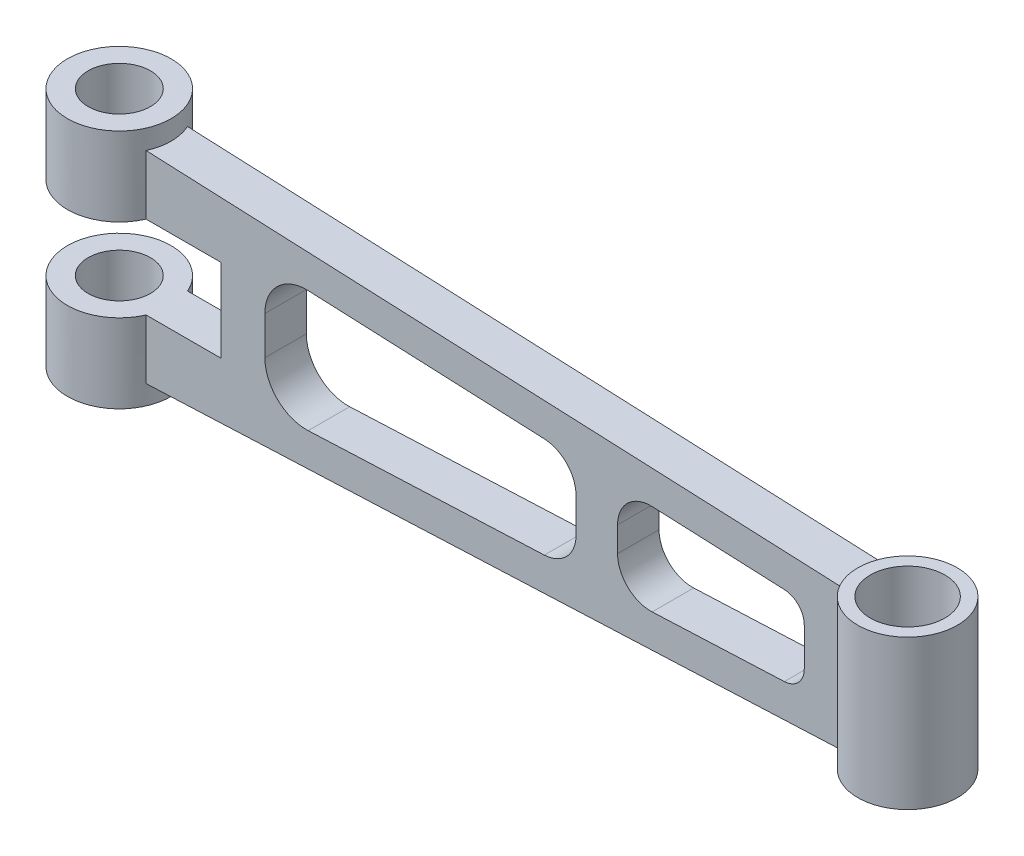
ISO-10303-21;
HEADER;
FILE_DESCRIPTION(('STEP AP214'),'2;1');
FILE_NAME('part.step','',(''),(''),'','','');
FILE_SCHEMA(('AUTOMOTIVE_DESIGN { 1 0 10303 214 1 1 1 1 }'));
ENDSEC;
DATA;
#1=APPLICATION_CONTEXT('core data for automotive mechanical design processes');
#2=APPLICATION_PROTOCOL_DEFINITION('international standard','automotive_design',2000,#1);
#3=PRODUCT_CONTEXT('',#1,'mechanical');
#4=PRODUCT('Part','Part','',(#3));
#5=PRODUCT_RELATED_PRODUCT_CATEGORY('part','',(#4));
#6=PRODUCT_DEFINITION_FORMATION('','',#4);
#7=PRODUCT_DEFINITION_CONTEXT('part definition',#1,'design');
#8=PRODUCT_DEFINITION('design','',#6,#7);
#9=PRODUCT_DEFINITION_SHAPE('','',#8);
#10=(LENGTH_UNIT() NAMED_UNIT(*) SI_UNIT(.MILLI.,.METRE.));
#11=(NAMED_UNIT(*) PLANE_ANGLE_UNIT() SI_UNIT($,.RADIAN.));
#12=(NAMED_UNIT(*) SI_UNIT($,.STERADIAN.) SOLID_ANGLE_UNIT());
#13=UNCERTAINTY_MEASURE_WITH_UNIT(LENGTH_MEASURE(1.E-05),#10,'distance_accuracy_value','');
#14=(GEOMETRIC_REPRESENTATION_CONTEXT(3) GLOBAL_UNCERTAINTY_ASSIGNED_CONTEXT((#13)) GLOBAL_UNIT_ASSIGNED_CONTEXT((#10,
#11,#12)) REPRESENTATION_CONTEXT('',''));
#15=CARTESIAN_POINT('',(0.,0.,0.));
#16=DIRECTION('',(0.,0.,1.));
#17=DIRECTION('',(1.,0.,0.));
#18=AXIS2_PLACEMENT_3D('',#15,#16,#17);
#19=CARTESIAN_POINT('',(0.,58.,0.));
#20=DIRECTION('',(0.,-1.,0.));
#21=DIRECTION('',(0.,0.,-1.));
#22=AXIS2_PLACEMENT_3D('',#19,#20,#21);
#23=CYLINDRICAL_SURFACE('',#22,7.5);
#24=CARTESIAN_POINT('',(0.,0.,0.));
#25=DIRECTION('',(0.,1.,0.));
#26=DIRECTION('',(0.,0.,1.));
#27=AXIS2_PLACEMENT_3D('',#24,#25,#26);
#28=CIRCLE('',#27,7.5);
#29=CARTESIAN_POINT('',(0.,0.,7.5));
#30=VERTEX_POINT('',#29);
#31=EDGE_CURVE('E384',#30,#30,#28,.T.);
#32=ORIENTED_EDGE('',*,*,#31,.F.);
#33=EDGE_LOOP('',(#32));
#34=FACE_BOUND('',#33,.T.);
#35=CARTESIAN_POINT('',(0.,19.,0.));
#36=DIRECTION('',(0.,1.,0.));
#37=DIRECTION('',(0.,0.,1.));
#38=AXIS2_PLACEMENT_3D('',#35,#36,#37);
#39=CIRCLE('',#38,7.5);
#40=CARTESIAN_POINT('',(0.,19.,7.5));
#41=VERTEX_POINT('',#40);
#42=EDGE_CURVE('E359',#41,#41,#39,.T.);
#43=ORIENTED_EDGE('',*,*,#42,.T.);
#44=EDGE_LOOP('',(#43));
#45=FACE_BOUND('',#44,.T.);
#46=ADVANCED_FACE('F102',(#34,#45),#23,.F.);
#47=CARTESIAN_POINT('',(0.,58.,0.));
#48=DIRECTION('',(0.,-1.,0.));
#49=DIRECTION('',(0.,0.,-1.));
#50=AXIS2_PLACEMENT_3D('',#47,#48,#49);
#51=CYLINDRICAL_SURFACE('',#50,12.5);
#52=DIRECTION('',(0.,-1.,0.));
#53=VECTOR('',#52,1.);
#54=CARTESIAN_POINT('',(11.4564392373896,58.,-5.));
#55=LINE('',#54,#53);
#56=CARTESIAN_POINT('',(11.4564392373896,19.,-5.));
#57=VERTEX_POINT('',#56);
#58=CARTESIAN_POINT('',(11.4564392373896,4.67223417417194,-5.));
#59=VERTEX_POINT('',#58);
#60=EDGE_CURVE('E277',#57,#59,#55,.T.);
#61=ORIENTED_EDGE('',*,*,#60,.T.);
#62=CARTESIAN_POINT('',(0.,4.17203523469344,0.));
#63=DIRECTION('',(0.0436193873653357,-0.999048221581858,0.));
#64=DIRECTION('',(-0.999048221581858,-0.0436193873653357,0.));
#65=AXIS2_PLACEMENT_3D('',#62,#63,#64);
#66=ELLIPSE('',#65,12.5119085645415,12.5);
#67=CARTESIAN_POINT('',(11.4564392373896,4.67223417417195,5.));
#68=VERTEX_POINT('',#67);
#69=EDGE_CURVE('E297',#68,#59,#66,.F.);
#70=ORIENTED_EDGE('',*,*,#69,.F.);
#71=DIRECTION('',(0.,-1.,0.));
#72=VECTOR('',#71,1.);
#73=CARTESIAN_POINT('',(11.4564392373896,58.,5.));
#74=LINE('',#73,#72);
#75=CARTESIAN_POINT('',(11.4564392373896,19.,5.));
#76=VERTEX_POINT('',#75);
#77=EDGE_CURVE('E276',#76,#68,#74,.T.);
#78=ORIENTED_EDGE('',*,*,#77,.F.);
#79=CARTESIAN_POINT('',(0.,19.,0.));
#80=DIRECTION('',(0.,1.,0.));
#81=DIRECTION('',(0.,0.,1.));
#82=AXIS2_PLACEMENT_3D('',#79,#80,#81);
#83=CIRCLE('',#82,12.5);
#84=EDGE_CURVE('E352',#57,#76,#83,.T.);
#85=ORIENTED_EDGE('',*,*,#84,.F.);
#86=EDGE_LOOP('',(#61,#70,#78,#85));
#87=FACE_BOUND('',#86,.T.);
#88=CARTESIAN_POINT('',(0.,0.,0.));
#89=DIRECTION('',(0.,1.,0.));
#90=DIRECTION('',(0.,0.,1.));
#91=AXIS2_PLACEMENT_3D('',#88,#89,#90);
#92=CIRCLE('',#91,12.5);
#93=CARTESIAN_POINT('',(0.,0.,12.5));
#94=VERTEX_POINT('',#93);
#95=EDGE_CURVE('E388',#94,#94,#92,.T.);
#96=ORIENTED_EDGE('',*,*,#95,.T.);
#97=EDGE_LOOP('',(#96));
#98=FACE_BOUND('',#97,.T.);
#99=ADVANCED_FACE('F601',(#87,#98),#51,.T.);
#100=CARTESIAN_POINT('',(11.4564392373896,53.3277658258281,5.));
#101=VERTEX_POINT('',#100);
#102=CARTESIAN_POINT('',(11.4564392373896,39.,5.));
#103=VERTEX_POINT('',#102);
#104=EDGE_CURVE('E293',#101,#103,#74,.T.);
#105=ORIENTED_EDGE('',*,*,#104,.F.);
#106=CARTESIAN_POINT('',(0.,53.8279647653067,0.));
#107=DIRECTION('',(-0.043619387365336,-0.999048221581858,0.));
#108=DIRECTION('',(-0.999048221581858,0.043619387365336,0.));
#109=AXIS2_PLACEMENT_3D('',#106,#107,#108);
#110=ELLIPSE('',#109,12.5119085645415,12.5);
#111=CARTESIAN_POINT('',(11.4564392373896,53.3277658258281,-5.));
#112=VERTEX_POINT('',#111);
#113=EDGE_CURVE('E281',#112,#101,#110,.T.);
#114=ORIENTED_EDGE('',*,*,#113,.F.);
#115=CARTESIAN_POINT('',(11.4564392373896,39.,-5.));
#116=VERTEX_POINT('',#115);
#117=EDGE_CURVE('E265',#112,#116,#55,.T.);
#118=ORIENTED_EDGE('',*,*,#117,.T.);
#119=CARTESIAN_POINT('',(0.,39.,0.));
#120=DIRECTION('',(0.,1.,0.));
#121=DIRECTION('',(0.,0.,1.));
#122=AXIS2_PLACEMENT_3D('',#119,#120,#121);
#123=CIRCLE('',#122,12.5);
#124=EDGE_CURVE('E363',#116,#103,#123,.T.);
#125=ORIENTED_EDGE('',*,*,#124,.T.);
#126=EDGE_LOOP('',(#105,#114,#118,#125));
#127=FACE_BOUND('',#126,.T.);
#128=CARTESIAN_POINT('',(0.,58.,0.));
#129=DIRECTION('',(0.,1.,0.));
#130=DIRECTION('',(0.,0.,1.));
#131=AXIS2_PLACEMENT_3D('',#128,#129,#130);
#132=CIRCLE('',#131,12.5);
#133=CARTESIAN_POINT('',(0.,58.,12.5));
#134=VERTEX_POINT('',#133);
#135=EDGE_CURVE('E379',#134,#134,#132,.T.);
#136=ORIENTED_EDGE('',*,*,#135,.F.);
#137=EDGE_LOOP('',(#136));
#138=FACE_BOUND('',#137,.T.);
#139=ADVANCED_FACE('F290',(#127,#138),#51,.T.);
#140=CARTESIAN_POINT('',(190.,58.,0.));
#141=DIRECTION('',(0.,-1.,0.));
#142=DIRECTION('',(0.,0.,-1.));
#143=AXIS2_PLACEMENT_3D('',#140,#141,#142);
#144=CYLINDRICAL_SURFACE('',#143,12.);
#145=DIRECTION('',(0.,-1.,0.));
#146=VECTOR('',#145,1.);
#147=CARTESIAN_POINT('',(179.091287885364,58.,-5.));
#148=LINE('',#147,#146);
#149=CARTESIAN_POINT('',(179.091287885364,46.0086702695319,-5.));
#150=VERTEX_POINT('',#149);
#151=CARTESIAN_POINT('',(179.091287885364,11.9913297304682,-5.));
#152=VERTEX_POINT('',#151);
#153=EDGE_CURVE('E378',#150,#152,#148,.T.);
#154=ORIENTED_EDGE('',*,*,#153,.F.);
#155=CARTESIAN_POINT('',(190.,45.5323856126894,0.));
#156=DIRECTION('',(-0.043619387365336,-0.999048221581858,0.));
#157=DIRECTION('',(-0.999048221581858,0.043619387365336,0.));
#158=AXIS2_PLACEMENT_3D('',#155,#156,#157);
#159=ELLIPSE('',#158,12.0114322219598,12.);
#160=CARTESIAN_POINT('',(179.091287885364,46.0086702695319,5.));
#161=VERTEX_POINT('',#160);
#162=EDGE_CURVE('E284',#161,#150,#159,.T.);
#163=ORIENTED_EDGE('',*,*,#162,.F.);
#164=DIRECTION('',(0.,-1.,0.));
#165=VECTOR('',#164,1.);
#166=CARTESIAN_POINT('',(179.091287885364,58.,5.));
#167=LINE('',#166,#165);
#168=CARTESIAN_POINT('',(179.091287885364,11.9913297304682,5.));
#169=VERTEX_POINT('',#168);
#170=EDGE_CURVE('E392',#161,#169,#167,.T.);
#171=ORIENTED_EDGE('',*,*,#170,.T.);
#172=CARTESIAN_POINT('',(190.,12.4676143873107,0.));
#173=DIRECTION('',(0.0436193873653357,-0.999048221581858,0.));
#174=DIRECTION('',(-0.999048221581858,-0.0436193873653357,0.));
#175=AXIS2_PLACEMENT_3D('',#172,#173,#174);
#176=ELLIPSE('',#175,12.0114322219598,12.);
#177=EDGE_CURVE('E302',#152,#169,#176,.F.);
#178=ORIENTED_EDGE('',*,*,#177,.F.);
#179=EDGE_LOOP('',(#154,#163,#171,#178));
#180=FACE_BOUND('',#179,.T.);
#181=CARTESIAN_POINT('',(190.,11.,0.));
#182=DIRECTION('',(0.,1.,0.));
#183=DIRECTION('',(-1.,0.,0.));
#184=AXIS2_PLACEMENT_3D('',#181,#182,#183);
#185=CIRCLE('',#184,12.);
#186=CARTESIAN_POINT('',(178.,11.,0.));
#187=VERTEX_POINT('',#186);
#188=EDGE_CURVE('E455',#187,#187,#185,.T.);
#189=ORIENTED_EDGE('',*,*,#188,.T.);
#190=EDGE_LOOP('',(#189));
#191=FACE_BOUND('',#190,.T.);
#192=CARTESIAN_POINT('',(190.,47.,0.));
#193=DIRECTION('',(0.,1.,0.));
#194=DIRECTION('',(-1.,0.,0.));
#195=AXIS2_PLACEMENT_3D('',#192,#193,#194);
#196=CIRCLE('',#195,12.);
#197=CARTESIAN_POINT('',(178.,47.,0.));
#198=VERTEX_POINT('',#197);
#199=EDGE_CURVE('E459',#198,#198,#196,.T.);
#200=ORIENTED_EDGE('',*,*,#199,.F.);
#201=EDGE_LOOP('',(#200));
#202=FACE_BOUND('',#201,.T.);
#203=ADVANCED_FACE('F700',(#180,#191,#202),#144,.T.);
#204=CARTESIAN_POINT('',(0.,58.,-5.));
#205=DIRECTION('',(0.,0.,-1.));
#206=DIRECTION('',(-1.,0.,0.));
#207=AXIS2_PLACEMENT_3D('',#204,#205,#206);
#208=PLANE('',#207);
#209=DIRECTION('',(-0.999048221581858,0.043619387365336,0.));
#210=VECTOR('',#209,1.);
#211=CARTESIAN_POINT('',(-0.18180841482455,53.8359026921266,-5.));
#212=LINE('',#211,#210);
#213=EDGE_CURVE('E269',#150,#112,#212,.T.);
#214=ORIENTED_EDGE('',*,*,#213,.F.);
#215=ORIENTED_EDGE('',*,*,#153,.T.);
#216=DIRECTION('',(-0.999048221581858,-0.0436193873653357,0.));
#217=VECTOR('',#216,1.);
#218=CARTESIAN_POINT('',(2.34570812485752,4.27445106321288,-5.));
#219=LINE('',#218,#217);
#220=EDGE_CURVE('E310',#152,#59,#219,.T.);
#221=ORIENTED_EDGE('',*,*,#220,.T.);
#222=ORIENTED_EDGE('',*,*,#60,.F.);
#223=DIRECTION('',(1.,0.,0.));
#224=VECTOR('',#223,1.);
#225=CARTESIAN_POINT('',(0.,19.,-5.));
#226=LINE('',#225,#224);
#227=CARTESIAN_POINT('',(29.5,19.,-5.));
#228=VERTEX_POINT('',#227);
#229=EDGE_CURVE('E355',#57,#228,#226,.T.);
#230=ORIENTED_EDGE('',*,*,#229,.T.);
#231=DIRECTION('',(0.,-1.,0.));
#232=VECTOR('',#231,1.);
#233=CARTESIAN_POINT('',(29.5,58.,-5.));
#234=LINE('',#233,#232);
#235=CARTESIAN_POINT('',(29.5,39.,-5.));
#236=VERTEX_POINT('',#235);
#237=EDGE_CURVE('E349',#236,#228,#234,.T.);
#238=ORIENTED_EDGE('',*,*,#237,.F.);
#239=DIRECTION('',(1.,0.,0.));
#240=VECTOR('',#239,1.);
#241=CARTESIAN_POINT('',(0.,39.,-5.));
#242=LINE('',#241,#240);
#243=EDGE_CURVE('E272',#116,#236,#242,.T.);
#244=ORIENTED_EDGE('',*,*,#243,.F.);
#245=ORIENTED_EDGE('',*,*,#117,.F.);
#246=EDGE_LOOP('',(#214,#215,#221,#222,#230,#238,#244,#245));
#247=FACE_BOUND('',#246,.T.);
#248=DIRECTION('',(-0.999048221581858,-0.043619387365336,0.));
#249=VECTOR('',#248,1.);
#250=CARTESIAN_POINT('',(1.99675302593485,12.2668368358677,-5.));
#251=LINE('',#250,#249);
#252=CARTESIAN_POINT('',(165.309384822191,19.3972203289629,-5.));
#253=VERTEX_POINT('',#252);
#254=CARTESIAN_POINT('',(133.440242984287,18.0057835466349,-5.));
#255=VERTEX_POINT('',#254);
#256=EDGE_CURVE('E317',#253,#255,#251,.T.);
#257=ORIENTED_EDGE('',*,*,#256,.F.);
#258=CARTESIAN_POINT('',(165.091287885364,24.3924614368722,-5.));
#259=DIRECTION('',(0.,0.,-1.));
#260=DIRECTION('',(-1.,0.,0.));
#261=AXIS2_PLACEMENT_3D('',#258,#259,#260);
#262=CIRCLE('',#261,5.);
#263=CARTESIAN_POINT('',(170.091287885364,24.3924614368722,-5.));
#264=VERTEX_POINT('',#263);
#265=EDGE_CURVE('E477',#253,#264,#262,.F.);
#266=ORIENTED_EDGE('',*,*,#265,.T.);
#267=DIRECTION('',(0.,1.,0.));
#268=VECTOR('',#267,1.);
#269=CARTESIAN_POINT('',(170.091287885364,58.,-5.));
#270=LINE('',#269,#268);
#271=CARTESIAN_POINT('',(170.091287885364,33.6075385631279,-5.));
#272=VERTEX_POINT('',#271);
#273=EDGE_CURVE('E329',#264,#272,#270,.T.);
#274=ORIENTED_EDGE('',*,*,#273,.T.);
#275=CARTESIAN_POINT('',(165.091287885364,33.6075385631279,-5.));
#276=DIRECTION('',(0.,0.,-1.));
#277=DIRECTION('',(-1.,0.,0.));
#278=AXIS2_PLACEMENT_3D('',#275,#276,#277);
#279=CIRCLE('',#278,5.);
#280=CARTESIAN_POINT('',(165.309384822191,38.6027796710372,-5.));
#281=VERTEX_POINT('',#280);
#282=EDGE_CURVE('E483',#272,#281,#279,.F.);
#283=ORIENTED_EDGE('',*,*,#282,.T.);
#284=DIRECTION('',(-0.999048221581858,0.043619387365336,0.));
#285=VECTOR('',#284,1.);
#286=CARTESIAN_POINT('',(-0.530763513747238,45.8435169194717,-5.));
#287=LINE('',#286,#285);
#288=CARTESIAN_POINT('',(133.440242984287,39.9942164533651,-5.));
#289=VERTEX_POINT('',#288);
#290=EDGE_CURVE('E325',#281,#289,#287,.T.);
#291=ORIENTED_EDGE('',*,*,#290,.T.);
#292=CARTESIAN_POINT('',(133.091287885364,32.0018306807103,-5.));
#293=DIRECTION('',(0.,0.,-1.));
#294=DIRECTION('',(-1.,0.,0.));
#295=AXIS2_PLACEMENT_3D('',#292,#293,#294);
#296=CIRCLE('',#295,8.);
#297=CARTESIAN_POINT('',(125.091287885364,32.0018306807103,-5.));
#298=VERTEX_POINT('',#297);
#299=EDGE_CURVE('E535',#289,#298,#296,.F.);
#300=ORIENTED_EDGE('',*,*,#299,.T.);
#301=DIRECTION('',(0.,-1.,0.));
#302=VECTOR('',#301,1.);
#303=CARTESIAN_POINT('',(125.091287885364,58.,-5.));
#304=LINE('',#303,#302);
#305=CARTESIAN_POINT('',(125.091287885364,25.9981693192897,-5.));
#306=VERTEX_POINT('',#305);
#307=EDGE_CURVE('E321',#298,#306,#304,.T.);
#308=ORIENTED_EDGE('',*,*,#307,.T.);
#309=CARTESIAN_POINT('',(133.091287885364,25.9981693192897,-5.));
#310=DIRECTION('',(0.,0.,-1.));
#311=DIRECTION('',(-1.,0.,0.));
#312=AXIS2_PLACEMENT_3D('',#309,#310,#311);
#313=CIRCLE('',#312,8.);
#314=EDGE_CURVE('E529',#306,#255,#313,.F.);
#315=ORIENTED_EDGE('',*,*,#314,.T.);
#316=EDGE_LOOP('',(#257,#266,#274,#283,#291,#300,#308,#315));
#317=FACE_BOUND('',#316,.T.);
#318=DIRECTION('',(-0.999048221581858,-0.0436193873653359,0.));
#319=VECTOR('',#318,1.);
#320=CARTESIAN_POINT('',(1.99675302593484,12.2668368358677,-5.));
#321=LINE('',#320,#319);
#322=CARTESIAN_POINT('',(107.440242984287,16.8705990310136,-5.));
#323=VERTEX_POINT('',#322);
#324=CARTESIAN_POINT('',(50.5274817590176,14.3857342123913,-5.));
#325=VERTEX_POINT('',#324);
#326=EDGE_CURVE('E333',#323,#325,#321,.T.);
#327=ORIENTED_EDGE('',*,*,#326,.F.);
#328=CARTESIAN_POINT('',(107.091287885364,24.8629848036684,-5.));
#329=DIRECTION('',(0.,0.,-1.));
#330=DIRECTION('',(-1.,0.,0.));
#331=AXIS2_PLACEMENT_3D('',#328,#329,#330);
#332=CIRCLE('',#331,8.);
#333=CARTESIAN_POINT('',(115.091287885364,24.8629848036684,-5.));
#334=VERTEX_POINT('',#333);
#335=EDGE_CURVE('E523',#323,#334,#332,.F.);
#336=ORIENTED_EDGE('',*,*,#335,.T.);
#337=DIRECTION('',(0.,1.,0.));
#338=VECTOR('',#337,1.);
#339=CARTESIAN_POINT('',(115.091287885364,58.,-5.));
#340=LINE('',#339,#338);
#341=CARTESIAN_POINT('',(115.091287885364,33.1370151963316,-5.));
#342=VERTEX_POINT('',#341);
#343=EDGE_CURVE('E345',#334,#342,#340,.T.);
#344=ORIENTED_EDGE('',*,*,#343,.T.);
#345=CARTESIAN_POINT('',(107.091287885364,33.1370151963316,-5.));
#346=DIRECTION('',(0.,0.,-1.));
#347=DIRECTION('',(-1.,0.,0.));
#348=AXIS2_PLACEMENT_3D('',#345,#346,#347);
#349=CIRCLE('',#348,8.);
#350=CARTESIAN_POINT('',(107.440242984287,41.1294009689865,-5.));
#351=VERTEX_POINT('',#350);
#352=EDGE_CURVE('E517',#342,#351,#349,.F.);
#353=ORIENTED_EDGE('',*,*,#352,.T.);
#354=DIRECTION('',(-0.999048221581858,0.0436193873653359,0.));
#355=VECTOR('',#354,1.);
#356=CARTESIAN_POINT('',(-0.530763513747238,45.8435169194717,-5.));
#357=LINE('',#356,#355);
#358=CARTESIAN_POINT('',(50.5274817590176,43.6142657876087,-5.));
#359=VERTEX_POINT('',#358);
#360=EDGE_CURVE('E341',#351,#359,#357,.T.);
#361=ORIENTED_EDGE('',*,*,#360,.T.);
#362=CARTESIAN_POINT('',(50.0912878853643,33.6237835717901,-5.));
#363=DIRECTION('',(0.,0.,-1.));
#364=DIRECTION('',(-1.,0.,0.));
#365=AXIS2_PLACEMENT_3D('',#362,#363,#364);
#366=CIRCLE('',#365,10.);
#367=CARTESIAN_POINT('',(40.0912878853643,33.6237835717901,-5.));
#368=VERTEX_POINT('',#367);
#369=EDGE_CURVE('E111',#359,#368,#366,.F.);
#370=ORIENTED_EDGE('',*,*,#369,.T.);
#371=DIRECTION('',(0.,-1.,0.));
#372=VECTOR('',#371,1.);
#373=CARTESIAN_POINT('',(40.0912878853643,58.,-5.));
#374=LINE('',#373,#372);
#375=CARTESIAN_POINT('',(40.0912878853643,24.3762164282099,-5.));
#376=VERTEX_POINT('',#375);
#377=EDGE_CURVE('E337',#368,#376,#374,.T.);
#378=ORIENTED_EDGE('',*,*,#377,.T.);
#379=CARTESIAN_POINT('',(50.0912878853643,24.3762164282099,-5.));
#380=DIRECTION('',(0.,0.,-1.));
#381=DIRECTION('',(-1.,0.,0.));
#382=AXIS2_PLACEMENT_3D('',#379,#380,#381);
#383=CIRCLE('',#382,10.);
#384=EDGE_CURVE('E554',#376,#325,#383,.F.);
#385=ORIENTED_EDGE('',*,*,#384,.T.);
#386=EDGE_LOOP('',(#327,#336,#344,#353,#361,#370,#378,#385));
#387=FACE_BOUND('',#386,.T.);
#388=ADVANCED_FACE('F267',(#247,#317,#387),#208,.T.);
#389=CARTESIAN_POINT('',(0.,58.,5.));
#390=DIRECTION('',(0.,0.,-1.));
#391=DIRECTION('',(-1.,0.,0.));
#392=AXIS2_PLACEMENT_3D('',#389,#390,#391);
#393=PLANE('',#392);
#394=DIRECTION('',(0.,1.,0.));
#395=VECTOR('',#394,1.);
#396=CARTESIAN_POINT('',(170.091287885364,58.,5.));
#397=LINE('',#396,#395);
#398=CARTESIAN_POINT('',(170.091287885364,24.3924614368722,5.));
#399=VERTEX_POINT('',#398);
#400=CARTESIAN_POINT('',(170.091287885364,33.6075385631279,5.));
#401=VERTEX_POINT('',#400);
#402=EDGE_CURVE('E421',#399,#401,#397,.T.);
#403=ORIENTED_EDGE('',*,*,#402,.F.);
#404=CARTESIAN_POINT('',(165.091287885364,24.3924614368722,5.));
#405=DIRECTION('',(0.,0.,-1.));
#406=DIRECTION('',(-1.,0.,0.));
#407=AXIS2_PLACEMENT_3D('',#404,#405,#406);
#408=CIRCLE('',#407,5.);
#409=CARTESIAN_POINT('',(165.309384822191,19.3972203289629,5.));
#410=VERTEX_POINT('',#409);
#411=EDGE_CURVE('E480',#399,#410,#408,.T.);
#412=ORIENTED_EDGE('',*,*,#411,.T.);
#413=DIRECTION('',(-0.999048221581858,-0.043619387365336,0.));
#414=VECTOR('',#413,1.);
#415=CARTESIAN_POINT('',(1.99675302593485,12.2668368358677,5.));
#416=LINE('',#415,#414);
#417=CARTESIAN_POINT('',(133.440242984287,18.0057835466349,5.));
#418=VERTEX_POINT('',#417);
#419=EDGE_CURVE('E409',#410,#418,#416,.T.);
#420=ORIENTED_EDGE('',*,*,#419,.T.);
#421=CARTESIAN_POINT('',(133.091287885364,25.9981693192897,5.));
#422=DIRECTION('',(0.,0.,-1.));
#423=DIRECTION('',(-1.,0.,0.));
#424=AXIS2_PLACEMENT_3D('',#421,#422,#423);
#425=CIRCLE('',#424,8.);
#426=CARTESIAN_POINT('',(125.091287885364,25.9981693192897,5.));
#427=VERTEX_POINT('',#426);
#428=EDGE_CURVE('E532',#418,#427,#425,.T.);
#429=ORIENTED_EDGE('',*,*,#428,.T.);
#430=DIRECTION('',(0.,-1.,0.));
#431=VECTOR('',#430,1.);
#432=CARTESIAN_POINT('',(125.091287885364,58.,5.));
#433=LINE('',#432,#431);
#434=CARTESIAN_POINT('',(125.091287885364,32.0018306807103,5.));
#435=VERTEX_POINT('',#434);
#436=EDGE_CURVE('E413',#435,#427,#433,.T.);
#437=ORIENTED_EDGE('',*,*,#436,.F.);
#438=CARTESIAN_POINT('',(133.091287885364,32.0018306807103,5.));
#439=DIRECTION('',(0.,0.,-1.));
#440=DIRECTION('',(-1.,0.,0.));
#441=AXIS2_PLACEMENT_3D('',#438,#439,#440);
#442=CIRCLE('',#441,8.);
#443=CARTESIAN_POINT('',(133.440242984287,39.9942164533651,5.));
#444=VERTEX_POINT('',#443);
#445=EDGE_CURVE('E538',#435,#444,#442,.T.);
#446=ORIENTED_EDGE('',*,*,#445,.T.);
#447=DIRECTION('',(-0.999048221581858,0.043619387365336,0.));
#448=VECTOR('',#447,1.);
#449=CARTESIAN_POINT('',(-0.530763513747238,45.8435169194717,5.));
#450=LINE('',#449,#448);
#451=CARTESIAN_POINT('',(165.309384822191,38.6027796710372,5.));
#452=VERTEX_POINT('',#451);
#453=EDGE_CURVE('E417',#452,#444,#450,.T.);
#454=ORIENTED_EDGE('',*,*,#453,.F.);
#455=CARTESIAN_POINT('',(165.091287885364,33.6075385631279,5.));
#456=DIRECTION('',(0.,0.,-1.));
#457=DIRECTION('',(-1.,0.,0.));
#458=AXIS2_PLACEMENT_3D('',#455,#456,#457);
#459=CIRCLE('',#458,5.);
#460=EDGE_CURVE('E486',#452,#401,#459,.T.);
#461=ORIENTED_EDGE('',*,*,#460,.T.);
#462=EDGE_LOOP('',(#403,#412,#420,#429,#437,#446,#454,#461));
#463=FACE_BOUND('',#462,.T.);
#464=ORIENTED_EDGE('',*,*,#170,.F.);
#465=DIRECTION('',(-0.999048221581858,0.043619387365336,0.));
#466=VECTOR('',#465,1.);
#467=CARTESIAN_POINT('',(-0.18180841482455,53.8359026921266,5.));
#468=LINE('',#467,#466);
#469=EDGE_CURVE('E452',#161,#101,#468,.T.);
#470=ORIENTED_EDGE('',*,*,#469,.T.);
#471=ORIENTED_EDGE('',*,*,#104,.T.);
#472=DIRECTION('',(1.,0.,0.));
#473=VECTOR('',#472,1.);
#474=CARTESIAN_POINT('',(0.,39.,5.));
#475=LINE('',#474,#473);
#476=CARTESIAN_POINT('',(29.5,39.,5.));
#477=VERTEX_POINT('',#476);
#478=EDGE_CURVE('E448',#103,#477,#475,.T.);
#479=ORIENTED_EDGE('',*,*,#478,.T.);
#480=DIRECTION('',(0.,-1.,0.));
#481=VECTOR('',#480,1.);
#482=CARTESIAN_POINT('',(29.5,58.,5.));
#483=LINE('',#482,#481);
#484=CARTESIAN_POINT('',(29.5,19.,5.));
#485=VERTEX_POINT('',#484);
#486=EDGE_CURVE('E440',#477,#485,#483,.T.);
#487=ORIENTED_EDGE('',*,*,#486,.T.);
#488=DIRECTION('',(1.,0.,0.));
#489=VECTOR('',#488,1.);
#490=CARTESIAN_POINT('',(0.,19.,5.));
#491=LINE('',#490,#489);
#492=EDGE_CURVE('E444',#76,#485,#491,.T.);
#493=ORIENTED_EDGE('',*,*,#492,.F.);
#494=ORIENTED_EDGE('',*,*,#77,.T.);
#495=DIRECTION('',(-0.999048221581858,-0.0436193873653357,0.));
#496=VECTOR('',#495,1.);
#497=CARTESIAN_POINT('',(2.34570812485752,4.27445106321288,5.));
#498=LINE('',#497,#496);
#499=EDGE_CURVE('E406',#169,#68,#498,.T.);
#500=ORIENTED_EDGE('',*,*,#499,.F.);
#501=EDGE_LOOP('',(#464,#470,#471,#479,#487,#493,#494,#500));
#502=FACE_BOUND('',#501,.T.);
#503=DIRECTION('',(0.,1.,0.));
#504=VECTOR('',#503,1.);
#505=CARTESIAN_POINT('',(115.091287885364,58.,5.));
#506=LINE('',#505,#504);
#507=CARTESIAN_POINT('',(115.091287885364,24.8629848036684,5.));
#508=VERTEX_POINT('',#507);
#509=CARTESIAN_POINT('',(115.091287885364,33.1370151963316,5.));
#510=VERTEX_POINT('',#509);
#511=EDGE_CURVE('E436',#508,#510,#506,.T.);
#512=ORIENTED_EDGE('',*,*,#511,.F.);
#513=CARTESIAN_POINT('',(107.091287885364,24.8629848036684,5.));
#514=DIRECTION('',(0.,0.,-1.));
#515=DIRECTION('',(-1.,0.,0.));
#516=AXIS2_PLACEMENT_3D('',#513,#514,#515);
#517=CIRCLE('',#516,8.);
#518=CARTESIAN_POINT('',(107.440242984287,16.8705990310136,5.));
#519=VERTEX_POINT('',#518);
#520=EDGE_CURVE('E526',#508,#519,#517,.T.);
#521=ORIENTED_EDGE('',*,*,#520,.T.);
#522=DIRECTION('',(-0.999048221581858,-0.0436193873653359,0.));
#523=VECTOR('',#522,1.);
#524=CARTESIAN_POINT('',(1.99675302593484,12.2668368358677,5.));
#525=LINE('',#524,#523);
#526=CARTESIAN_POINT('',(50.5274817590176,14.3857342123913,5.));
#527=VERTEX_POINT('',#526);
#528=EDGE_CURVE('E425',#519,#527,#525,.T.);
#529=ORIENTED_EDGE('',*,*,#528,.T.);
#530=CARTESIAN_POINT('',(50.0912878853643,24.3762164282099,5.));
#531=DIRECTION('',(0.,0.,-1.));
#532=DIRECTION('',(-1.,0.,0.));
#533=AXIS2_PLACEMENT_3D('',#530,#531,#532);
#534=CIRCLE('',#533,10.);
#535=CARTESIAN_POINT('',(40.0912878853643,24.3762164282099,5.));
#536=VERTEX_POINT('',#535);
#537=EDGE_CURVE('E557',#527,#536,#534,.T.);
#538=ORIENTED_EDGE('',*,*,#537,.T.);
#539=DIRECTION('',(0.,-1.,0.));
#540=VECTOR('',#539,1.);
#541=CARTESIAN_POINT('',(40.0912878853643,58.,5.));
#542=LINE('',#541,#540);
#543=CARTESIAN_POINT('',(40.0912878853643,33.6237835717901,5.));
#544=VERTEX_POINT('',#543);
#545=EDGE_CURVE('E429',#544,#536,#542,.T.);
#546=ORIENTED_EDGE('',*,*,#545,.F.);
#547=CARTESIAN_POINT('',(50.0912878853643,33.6237835717901,5.));
#548=DIRECTION('',(0.,0.,-1.));
#549=DIRECTION('',(-1.,0.,0.));
#550=AXIS2_PLACEMENT_3D('',#547,#548,#549);
#551=CIRCLE('',#550,10.);
#552=CARTESIAN_POINT('',(50.5274817590176,43.6142657876087,5.));
#553=VERTEX_POINT('',#552);
#554=EDGE_CURVE('E12',#544,#553,#551,.T.);
#555=ORIENTED_EDGE('',*,*,#554,.T.);
#556=DIRECTION('',(-0.999048221581858,0.0436193873653359,0.));
#557=VECTOR('',#556,1.);
#558=CARTESIAN_POINT('',(-0.530763513747238,45.8435169194717,5.));
#559=LINE('',#558,#557);
#560=CARTESIAN_POINT('',(107.440242984287,41.1294009689865,5.));
#561=VERTEX_POINT('',#560);
#562=EDGE_CURVE('E433',#561,#553,#559,.T.);
#563=ORIENTED_EDGE('',*,*,#562,.F.);
#564=CARTESIAN_POINT('',(107.091287885364,33.1370151963316,5.));
#565=DIRECTION('',(0.,0.,-1.));
#566=DIRECTION('',(-1.,0.,0.));
#567=AXIS2_PLACEMENT_3D('',#564,#565,#566);
#568=CIRCLE('',#567,8.);
#569=EDGE_CURVE('E520',#561,#510,#568,.T.);
#570=ORIENTED_EDGE('',*,*,#569,.T.);
#571=EDGE_LOOP('',(#512,#521,#529,#538,#546,#555,#563,#570));
#572=FACE_BOUND('',#571,.T.);
#573=ADVANCED_FACE('F572',(#463,#502,#572),#393,.F.);
#574=CARTESIAN_POINT('',(0.,39.,0.));
#575=DIRECTION('',(0.,1.,0.));
#576=DIRECTION('',(0.,0.,1.));
#577=AXIS2_PLACEMENT_3D('',#574,#575,#576);
#578=CIRCLE('',#577,7.5);
#579=CARTESIAN_POINT('',(0.,39.,7.5));
#580=VERTEX_POINT('',#579);
#581=EDGE_CURVE('E287',#580,#580,#578,.T.);
#582=ORIENTED_EDGE('',*,*,#581,.F.);
#583=EDGE_LOOP('',(#582));
#584=FACE_BOUND('',#583,.T.);
#585=CARTESIAN_POINT('',(0.,58.,0.));
#586=DIRECTION('',(0.,1.,0.));
#587=DIRECTION('',(0.,0.,1.));
#588=AXIS2_PLACEMENT_3D('',#585,#586,#587);
#589=CIRCLE('',#588,7.5);
#590=CARTESIAN_POINT('',(0.,58.,7.5));
#591=VERTEX_POINT('',#590);
#592=EDGE_CURVE('E383',#591,#591,#589,.T.);
#593=ORIENTED_EDGE('',*,*,#592,.T.);
#594=EDGE_LOOP('',(#593));
#595=FACE_BOUND('',#594,.T.);
#596=ADVANCED_FACE('F604',(#584,#595),#23,.F.);
#597=CARTESIAN_POINT('',(0.,0.,0.));
#598=DIRECTION('',(0.,1.,0.));
#599=DIRECTION('',(0.,0.,1.));
#600=AXIS2_PLACEMENT_3D('',#597,#598,#599);
#601=PLANE('',#600);
#602=ORIENTED_EDGE('',*,*,#95,.F.);
#603=EDGE_LOOP('',(#602));
#604=FACE_BOUND('',#603,.T.);
#605=ORIENTED_EDGE('',*,*,#31,.T.);
#606=EDGE_LOOP('',(#605));
#607=FACE_BOUND('',#606,.T.);
#608=ADVANCED_FACE('F614',(#604,#607),#601,.F.);
#609=CARTESIAN_POINT('',(0.,58.,0.));
#610=DIRECTION('',(0.,1.,0.));
#611=DIRECTION('',(0.,0.,1.));
#612=AXIS2_PLACEMENT_3D('',#609,#610,#611);
#613=PLANE('',#612);
#614=ORIENTED_EDGE('',*,*,#135,.T.);
#615=EDGE_LOOP('',(#614));
#616=FACE_BOUND('',#615,.T.);
#617=ORIENTED_EDGE('',*,*,#592,.F.);
#618=EDGE_LOOP('',(#617));
#619=FACE_BOUND('',#618,.T.);
#620=ADVANCED_FACE('F616',(#616,#619),#613,.T.);
#621=CARTESIAN_POINT('',(0.,11.,12.5));
#622=DIRECTION('',(0.,1.,0.));
#623=DIRECTION('',(-1.,0.,0.));
#624=AXIS2_PLACEMENT_3D('',#621,#622,#623);
#625=PLANE('',#624);
#626=CARTESIAN_POINT('',(190.,11.,0.));
#627=DIRECTION('',(0.,1.,0.));
#628=DIRECTION('',(-1.,0.,0.));
#629=AXIS2_PLACEMENT_3D('',#626,#627,#628);
#630=CIRCLE('',#629,9.00000000000001);
#631=CARTESIAN_POINT('',(181.,11.,0.));
#632=VERTEX_POINT('',#631);
#633=EDGE_CURVE('E286',#632,#632,#630,.T.);
#634=ORIENTED_EDGE('',*,*,#633,.T.);
#635=EDGE_LOOP('',(#634));
#636=FACE_BOUND('',#635,.T.);
#637=ORIENTED_EDGE('',*,*,#188,.F.);
#638=EDGE_LOOP('',(#637));
#639=FACE_BOUND('',#638,.T.);
#640=ADVANCED_FACE('F627',(#636,#639),#625,.F.);
#641=CARTESIAN_POINT('',(-0.181808414824552,4.1640973078735,12.5));
#642=DIRECTION('',(0.0436193873653357,-0.999048221581858,0.));
#643=DIRECTION('',(0.999048221581858,0.0436193873653357,0.));
#644=AXIS2_PLACEMENT_3D('',#641,#642,#643);
#645=PLANE('',#644);
#646=ORIENTED_EDGE('',*,*,#69,.T.);
#647=ORIENTED_EDGE('',*,*,#220,.F.);
#648=ORIENTED_EDGE('',*,*,#177,.T.);
#649=ORIENTED_EDGE('',*,*,#499,.T.);
#650=EDGE_LOOP('',(#646,#647,#648,#649));
#651=FACE_BOUND('',#650,.T.);
#652=ADVANCED_FACE('F633',(#651),#645,.T.);
#653=CARTESIAN_POINT('',(170.091287885364,0.,12.5));
#654=DIRECTION('',(-1.,0.,0.));
#655=DIRECTION('',(0.,0.,1.));
#656=AXIS2_PLACEMENT_3D('',#653,#654,#655);
#657=PLANE('',#656);
#658=ORIENTED_EDGE('',*,*,#273,.F.);
#659=DIRECTION('',(0.,0.,-1.));
#660=VECTOR('',#659,1.);
#661=CARTESIAN_POINT('',(170.091287885364,24.3924614368722,12.5));
#662=LINE('',#661,#660);
#663=EDGE_CURVE('E471',#264,#399,#662,.F.);
#664=ORIENTED_EDGE('',*,*,#663,.T.);
#665=ORIENTED_EDGE('',*,*,#402,.T.);
#666=DIRECTION('',(0.,0.,-1.));
#667=VECTOR('',#666,1.);
#668=CARTESIAN_POINT('',(170.091287885364,33.6075385631279,-5.));
#669=LINE('',#668,#667);
#670=EDGE_CURVE('E467',#401,#272,#669,.T.);
#671=ORIENTED_EDGE('',*,*,#670,.T.);
#672=EDGE_LOOP('',(#658,#664,#665,#671));
#673=FACE_BOUND('',#672,.T.);
#674=ADVANCED_FACE('F638',(#673),#657,.T.);
#675=CARTESIAN_POINT('',(1.99675302593485,45.7331631641323,12.5));
#676=DIRECTION('',(-0.043619387365336,-0.999048221581858,0.));
#677=DIRECTION('',(0.999048221581858,-0.043619387365336,0.));
#678=AXIS2_PLACEMENT_3D('',#675,#676,#677);
#679=PLANE('',#678);
#680=ORIENTED_EDGE('',*,*,#453,.T.);
#681=DIRECTION('',(0.,0.,-1.));
#682=VECTOR('',#681,1.);
#683=CARTESIAN_POINT('',(133.440242984287,39.9942164533651,-5.));
#684=LINE('',#683,#682);
#685=EDGE_CURVE('E513',#444,#289,#684,.T.);
#686=ORIENTED_EDGE('',*,*,#685,.T.);
#687=ORIENTED_EDGE('',*,*,#290,.F.);
#688=DIRECTION('',(0.,0.,-1.));
#689=VECTOR('',#688,1.);
#690=CARTESIAN_POINT('',(165.309384822191,38.6027796710372,5.));
#691=LINE('',#690,#689);
#692=EDGE_CURVE('E474',#281,#452,#691,.F.);
#693=ORIENTED_EDGE('',*,*,#692,.T.);
#694=EDGE_LOOP('',(#680,#686,#687,#693));
#695=FACE_BOUND('',#694,.T.);
#696=ADVANCED_FACE('F641',(#695),#679,.T.);
#697=CARTESIAN_POINT('',(125.091287885364,0.,12.5));
#698=DIRECTION('',(1.,0.,0.));
#699=DIRECTION('',(0.,0.,-1.));
#700=AXIS2_PLACEMENT_3D('',#697,#698,#699);
#701=PLANE('',#700);
#702=ORIENTED_EDGE('',*,*,#436,.T.);
#703=DIRECTION('',(0.,0.,-1.));
#704=VECTOR('',#703,1.);
#705=CARTESIAN_POINT('',(125.091287885364,25.9981693192897,12.5));
#706=LINE('',#705,#704);
#707=EDGE_CURVE('E506',#427,#306,#706,.T.);
#708=ORIENTED_EDGE('',*,*,#707,.T.);
#709=ORIENTED_EDGE('',*,*,#307,.F.);
#710=DIRECTION('',(0.,0.,-1.));
#711=VECTOR('',#710,1.);
#712=CARTESIAN_POINT('',(125.091287885364,32.0018306807103,5.));
#713=LINE('',#712,#711);
#714=EDGE_CURVE('E503',#298,#435,#713,.F.);
#715=ORIENTED_EDGE('',*,*,#714,.T.);
#716=EDGE_LOOP('',(#702,#708,#709,#715));
#717=FACE_BOUND('',#716,.T.);
#718=ADVANCED_FACE('F646',(#717),#701,.T.);
#719=CARTESIAN_POINT('',(-0.530763513747239,12.1564830805283,12.5));
#720=DIRECTION('',(0.043619387365336,-0.999048221581858,0.));
#721=DIRECTION('',(0.999048221581858,0.043619387365336,0.));
#722=AXIS2_PLACEMENT_3D('',#719,#720,#721);
#723=PLANE('',#722);
#724=ORIENTED_EDGE('',*,*,#256,.T.);
#725=DIRECTION('',(0.,0.,-1.));
#726=VECTOR('',#725,1.);
#727=CARTESIAN_POINT('',(133.440242984287,18.0057835466349,12.5));
#728=LINE('',#727,#726);
#729=EDGE_CURVE('E510',#255,#418,#728,.F.);
#730=ORIENTED_EDGE('',*,*,#729,.T.);
#731=ORIENTED_EDGE('',*,*,#419,.F.);
#732=DIRECTION('',(0.,0.,-1.));
#733=VECTOR('',#732,1.);
#734=CARTESIAN_POINT('',(165.309384822191,19.3972203289629,12.5));
#735=LINE('',#734,#733);
#736=EDGE_CURVE('E463',#410,#253,#735,.T.);
#737=ORIENTED_EDGE('',*,*,#736,.T.);
#738=EDGE_LOOP('',(#724,#730,#731,#737));
#739=FACE_BOUND('',#738,.T.);
#740=ADVANCED_FACE('F643',(#739),#723,.F.);
#741=CARTESIAN_POINT('',(115.091287885364,0.,12.5));
#742=DIRECTION('',(-1.,0.,0.));
#743=DIRECTION('',(0.,0.,1.));
#744=AXIS2_PLACEMENT_3D('',#741,#742,#743);
#745=PLANE('',#744);
#746=ORIENTED_EDGE('',*,*,#511,.T.);
#747=DIRECTION('',(0.,0.,-1.));
#748=VECTOR('',#747,1.);
#749=CARTESIAN_POINT('',(115.091287885364,33.1370151963316,-5.));
#750=LINE('',#749,#748);
#751=EDGE_CURVE('E492',#510,#342,#750,.T.);
#752=ORIENTED_EDGE('',*,*,#751,.T.);
#753=ORIENTED_EDGE('',*,*,#343,.F.);
#754=DIRECTION('',(0.,0.,-1.));
#755=VECTOR('',#754,1.);
#756=CARTESIAN_POINT('',(115.091287885364,24.8629848036684,12.5));
#757=LINE('',#756,#755);
#758=EDGE_CURVE('E489',#334,#508,#757,.F.);
#759=ORIENTED_EDGE('',*,*,#758,.T.);
#760=EDGE_LOOP('',(#746,#752,#753,#759));
#761=FACE_BOUND('',#760,.T.);
#762=ADVANCED_FACE('F578',(#761),#745,.T.);
#763=CARTESIAN_POINT('',(1.99675302593485,45.7331631641323,12.5));
#764=DIRECTION('',(-0.0436193873653359,-0.999048221581858,0.));
#765=DIRECTION('',(0.999048221581858,-0.0436193873653359,0.));
#766=AXIS2_PLACEMENT_3D('',#763,#764,#765);
#767=PLANE('',#766);
#768=ORIENTED_EDGE('',*,*,#562,.T.);
#769=DIRECTION('',(0.,0.,-1.));
#770=VECTOR('',#769,1.);
#771=CARTESIAN_POINT('',(50.5274817590176,43.6142657876087,-5.));
#772=LINE('',#771,#770);
#773=EDGE_CURVE('E551',#553,#359,#772,.T.);
#774=ORIENTED_EDGE('',*,*,#773,.T.);
#775=ORIENTED_EDGE('',*,*,#360,.F.);
#776=DIRECTION('',(0.,0.,-1.));
#777=VECTOR('',#776,1.);
#778=CARTESIAN_POINT('',(107.440242984287,41.1294009689865,5.));
#779=LINE('',#778,#777);
#780=EDGE_CURVE('E496',#351,#561,#779,.F.);
#781=ORIENTED_EDGE('',*,*,#780,.T.);
#782=EDGE_LOOP('',(#768,#774,#775,#781));
#783=FACE_BOUND('',#782,.T.);
#784=ADVANCED_FACE('F568',(#783),#767,.T.);
#785=CARTESIAN_POINT('',(40.0912878853643,0.,12.5));
#786=DIRECTION('',(1.,0.,0.));
#787=DIRECTION('',(0.,0.,-1.));
#788=AXIS2_PLACEMENT_3D('',#785,#786,#787);
#789=PLANE('',#788);
#790=ORIENTED_EDGE('',*,*,#545,.T.);
#791=DIRECTION('',(0.,0.,-1.));
#792=VECTOR('',#791,1.);
#793=CARTESIAN_POINT('',(40.0912878853643,24.3762164282099,12.5));
#794=LINE('',#793,#792);
#795=EDGE_CURVE('E544',#536,#376,#794,.T.);
#796=ORIENTED_EDGE('',*,*,#795,.T.);
#797=ORIENTED_EDGE('',*,*,#377,.F.);
#798=DIRECTION('',(0.,0.,-1.));
#799=VECTOR('',#798,1.);
#800=CARTESIAN_POINT('',(40.0912878853643,33.6237835717901,5.));
#801=LINE('',#800,#799);
#802=EDGE_CURVE('E541',#368,#544,#801,.F.);
#803=ORIENTED_EDGE('',*,*,#802,.T.);
#804=EDGE_LOOP('',(#790,#796,#797,#803));
#805=FACE_BOUND('',#804,.T.);
#806=ADVANCED_FACE('F565',(#805),#789,.T.);
#807=CARTESIAN_POINT('',(-0.530763513747239,12.1564830805283,12.5));
#808=DIRECTION('',(0.0436193873653359,-0.999048221581858,0.));
#809=DIRECTION('',(0.999048221581858,0.0436193873653359,0.));
#810=AXIS2_PLACEMENT_3D('',#807,#808,#809);
#811=PLANE('',#810);
#812=ORIENTED_EDGE('',*,*,#326,.T.);
#813=DIRECTION('',(0.,0.,-1.));
#814=VECTOR('',#813,1.);
#815=CARTESIAN_POINT('',(50.5274817590176,14.3857342123913,12.5));
#816=LINE('',#815,#814);
#817=EDGE_CURVE('E548',#325,#527,#816,.F.);
#818=ORIENTED_EDGE('',*,*,#817,.T.);
#819=ORIENTED_EDGE('',*,*,#528,.F.);
#820=DIRECTION('',(0.,0.,-1.));
#821=VECTOR('',#820,1.);
#822=CARTESIAN_POINT('',(107.440242984287,16.8705990310136,12.5));
#823=LINE('',#822,#821);
#824=EDGE_CURVE('E499',#519,#323,#823,.T.);
#825=ORIENTED_EDGE('',*,*,#824,.T.);
#826=EDGE_LOOP('',(#812,#818,#819,#825));
#827=FACE_BOUND('',#826,.T.);
#828=ADVANCED_FACE('F586',(#827),#811,.F.);
#829=CARTESIAN_POINT('',(0.,39.,12.5));
#830=DIRECTION('',(0.,1.,0.));
#831=DIRECTION('',(0.,0.,1.));
#832=AXIS2_PLACEMENT_3D('',#829,#830,#831);
#833=PLANE('',#832);
#834=ORIENTED_EDGE('',*,*,#581,.T.);
#835=EDGE_LOOP('',(#834));
#836=FACE_BOUND('',#835,.T.);
#837=ORIENTED_EDGE('',*,*,#243,.T.);
#838=DIRECTION('',(0.,0.,-1.));
#839=VECTOR('',#838,1.);
#840=CARTESIAN_POINT('',(29.5,39.,12.5));
#841=LINE('',#840,#839);
#842=EDGE_CURVE('E305',#477,#236,#841,.T.);
#843=ORIENTED_EDGE('',*,*,#842,.F.);
#844=ORIENTED_EDGE('',*,*,#478,.F.);
#845=ORIENTED_EDGE('',*,*,#124,.F.);
#846=EDGE_LOOP('',(#837,#843,#844,#845));
#847=FACE_BOUND('',#846,.T.);
#848=ADVANCED_FACE('F657',(#836,#847),#833,.F.);
#849=CARTESIAN_POINT('',(0.,19.,12.5));
#850=DIRECTION('',(0.,1.,0.));
#851=DIRECTION('',(0.,0.,1.));
#852=AXIS2_PLACEMENT_3D('',#849,#850,#851);
#853=PLANE('',#852);
#854=ORIENTED_EDGE('',*,*,#42,.F.);
#855=EDGE_LOOP('',(#854));
#856=FACE_BOUND('',#855,.T.);
#857=ORIENTED_EDGE('',*,*,#84,.T.);
#858=ORIENTED_EDGE('',*,*,#492,.T.);
#859=DIRECTION('',(0.,0.,-1.));
#860=VECTOR('',#859,1.);
#861=CARTESIAN_POINT('',(29.5,19.,12.5));
#862=LINE('',#861,#860);
#863=EDGE_CURVE('E306',#485,#228,#862,.T.);
#864=ORIENTED_EDGE('',*,*,#863,.T.);
#865=ORIENTED_EDGE('',*,*,#229,.F.);
#866=EDGE_LOOP('',(#857,#858,#864,#865));
#867=FACE_BOUND('',#866,.T.);
#868=ADVANCED_FACE('F660',(#856,#867),#853,.T.);
#869=CARTESIAN_POINT('',(29.5,0.,12.5));
#870=DIRECTION('',(1.,0.,0.));
#871=DIRECTION('',(0.,1.,0.));
#872=AXIS2_PLACEMENT_3D('',#869,#870,#871);
#873=PLANE('',#872);
#874=ORIENTED_EDGE('',*,*,#237,.T.);
#875=ORIENTED_EDGE('',*,*,#863,.F.);
#876=ORIENTED_EDGE('',*,*,#486,.F.);
#877=ORIENTED_EDGE('',*,*,#842,.T.);
#878=EDGE_LOOP('',(#874,#875,#876,#877));
#879=FACE_BOUND('',#878,.T.);
#880=ADVANCED_FACE('F662',(#879),#873,.F.);
#881=CARTESIAN_POINT('',(0.,47.0000000000001,12.5));
#882=DIRECTION('',(0.,1.,0.));
#883=DIRECTION('',(-1.,0.,0.));
#884=AXIS2_PLACEMENT_3D('',#881,#882,#883);
#885=PLANE('',#884);
#886=CARTESIAN_POINT('',(190.,47.,0.));
#887=DIRECTION('',(0.,1.,0.));
#888=DIRECTION('',(-1.,0.,0.));
#889=AXIS2_PLACEMENT_3D('',#886,#887,#888);
#890=CIRCLE('',#889,9.00000000000001);
#891=CARTESIAN_POINT('',(181.,47.,0.));
#892=VERTEX_POINT('',#891);
#893=EDGE_CURVE('E374',#892,#892,#890,.T.);
#894=ORIENTED_EDGE('',*,*,#893,.F.);
#895=EDGE_LOOP('',(#894));
#896=FACE_BOUND('',#895,.T.);
#897=ORIENTED_EDGE('',*,*,#199,.T.);
#898=EDGE_LOOP('',(#897));
#899=FACE_BOUND('',#898,.T.);
#900=ADVANCED_FACE('F665',(#896,#899),#885,.T.);
#901=CARTESIAN_POINT('',(2.34570812485754,53.7255489367872,12.5));
#902=DIRECTION('',(-0.043619387365336,-0.999048221581858,0.));
#903=DIRECTION('',(0.999048221581858,-0.043619387365336,0.));
#904=AXIS2_PLACEMENT_3D('',#901,#902,#903);
#905=PLANE('',#904);
#906=ORIENTED_EDGE('',*,*,#113,.T.);
#907=ORIENTED_EDGE('',*,*,#469,.F.);
#908=ORIENTED_EDGE('',*,*,#162,.T.);
#909=ORIENTED_EDGE('',*,*,#213,.T.);
#910=EDGE_LOOP('',(#906,#907,#908,#909));
#911=FACE_BOUND('',#910,.T.);
#912=ADVANCED_FACE('F280',(#911),#905,.F.);
#913=CARTESIAN_POINT('',(190.,58.,0.));
#914=DIRECTION('',(0.,-1.,0.));
#915=DIRECTION('',(0.,0.,-1.));
#916=AXIS2_PLACEMENT_3D('',#913,#914,#915);
#917=CYLINDRICAL_SURFACE('',#916,9.00000000000001);
#918=ORIENTED_EDGE('',*,*,#633,.F.);
#919=EDGE_LOOP('',(#918));
#920=FACE_BOUND('',#919,.T.);
#921=ORIENTED_EDGE('',*,*,#893,.T.);
#922=EDGE_LOOP('',(#921));
#923=FACE_BOUND('',#922,.T.);
#924=ADVANCED_FACE('F682',(#920,#923),#917,.F.);
#925=CARTESIAN_POINT('',(165.091287885364,24.3924614368722,12.5));
#926=DIRECTION('',(0.,0.,-1.));
#927=DIRECTION('',(-1.,0.,0.));
#928=AXIS2_PLACEMENT_3D('',#925,#926,#927);
#929=CYLINDRICAL_SURFACE('',#928,5.);
#930=ORIENTED_EDGE('',*,*,#411,.F.);
#931=ORIENTED_EDGE('',*,*,#663,.F.);
#932=ORIENTED_EDGE('',*,*,#265,.F.);
#933=ORIENTED_EDGE('',*,*,#736,.F.);
#934=EDGE_LOOP('',(#930,#931,#932,#933));
#935=FACE_BOUND('',#934,.T.);
#936=ADVANCED_FACE('F686',(#935),#929,.F.);
#937=CARTESIAN_POINT('',(165.091287885364,33.6075385631279,12.5));
#938=DIRECTION('',(0.,0.,1.));
#939=DIRECTION('',(1.,0.,0.));
#940=AXIS2_PLACEMENT_3D('',#937,#938,#939);
#941=CYLINDRICAL_SURFACE('',#940,5.);
#942=ORIENTED_EDGE('',*,*,#460,.F.);
#943=ORIENTED_EDGE('',*,*,#692,.F.);
#944=ORIENTED_EDGE('',*,*,#282,.F.);
#945=ORIENTED_EDGE('',*,*,#670,.F.);
#946=EDGE_LOOP('',(#942,#943,#944,#945));
#947=FACE_BOUND('',#946,.T.);
#948=ADVANCED_FACE('F692',(#947),#941,.F.);
#949=CARTESIAN_POINT('',(107.091287885364,33.1370151963316,12.5));
#950=DIRECTION('',(0.,0.,1.));
#951=DIRECTION('',(1.,0.,0.));
#952=AXIS2_PLACEMENT_3D('',#949,#950,#951);
#953=CYLINDRICAL_SURFACE('',#952,8.);
#954=ORIENTED_EDGE('',*,*,#569,.F.);
#955=ORIENTED_EDGE('',*,*,#780,.F.);
#956=ORIENTED_EDGE('',*,*,#352,.F.);
#957=ORIENTED_EDGE('',*,*,#751,.F.);
#958=EDGE_LOOP('',(#954,#955,#956,#957));
#959=FACE_BOUND('',#958,.T.);
#960=ADVANCED_FACE('F575',(#959),#953,.F.);
#961=CARTESIAN_POINT('',(107.091287885364,24.8629848036684,12.5));
#962=DIRECTION('',(0.,0.,-1.));
#963=DIRECTION('',(-1.,0.,0.));
#964=AXIS2_PLACEMENT_3D('',#961,#962,#963);
#965=CYLINDRICAL_SURFACE('',#964,8.);
#966=ORIENTED_EDGE('',*,*,#520,.F.);
#967=ORIENTED_EDGE('',*,*,#758,.F.);
#968=ORIENTED_EDGE('',*,*,#335,.F.);
#969=ORIENTED_EDGE('',*,*,#824,.F.);
#970=EDGE_LOOP('',(#966,#967,#968,#969));
#971=FACE_BOUND('',#970,.T.);
#972=ADVANCED_FACE('F583',(#971),#965,.F.);
#973=CARTESIAN_POINT('',(133.091287885364,25.9981693192897,12.5));
#974=DIRECTION('',(0.,0.,-1.));
#975=DIRECTION('',(-1.,0.,0.));
#976=AXIS2_PLACEMENT_3D('',#973,#974,#975);
#977=CYLINDRICAL_SURFACE('',#976,8.);
#978=ORIENTED_EDGE('',*,*,#428,.F.);
#979=ORIENTED_EDGE('',*,*,#729,.F.);
#980=ORIENTED_EDGE('',*,*,#314,.F.);
#981=ORIENTED_EDGE('',*,*,#707,.F.);
#982=EDGE_LOOP('',(#978,#979,#980,#981));
#983=FACE_BOUND('',#982,.T.);
#984=ADVANCED_FACE('F597',(#983),#977,.F.);
#985=CARTESIAN_POINT('',(133.091287885364,32.0018306807103,12.5));
#986=DIRECTION('',(0.,0.,1.));
#987=DIRECTION('',(1.,0.,0.));
#988=AXIS2_PLACEMENT_3D('',#985,#986,#987);
#989=CYLINDRICAL_SURFACE('',#988,8.);
#990=ORIENTED_EDGE('',*,*,#445,.F.);
#991=ORIENTED_EDGE('',*,*,#714,.F.);
#992=ORIENTED_EDGE('',*,*,#299,.F.);
#993=ORIENTED_EDGE('',*,*,#685,.F.);
#994=EDGE_LOOP('',(#990,#991,#992,#993));
#995=FACE_BOUND('',#994,.T.);
#996=ADVANCED_FACE('F592',(#995),#989,.F.);
#997=CARTESIAN_POINT('',(50.0912878853643,24.3762164282099,12.5));
#998=DIRECTION('',(0.,0.,-1.));
#999=DIRECTION('',(-1.,0.,0.));
#1000=AXIS2_PLACEMENT_3D('',#997,#998,#999);
#1001=CYLINDRICAL_SURFACE('',#1000,10.);
#1002=ORIENTED_EDGE('',*,*,#537,.F.);
#1003=ORIENTED_EDGE('',*,*,#817,.F.);
#1004=ORIENTED_EDGE('',*,*,#384,.F.);
#1005=ORIENTED_EDGE('',*,*,#795,.F.);
#1006=EDGE_LOOP('',(#1002,#1003,#1004,#1005));
#1007=FACE_BOUND('',#1006,.T.);
#1008=ADVANCED_FACE('F590',(#1007),#1001,.F.);
#1009=CARTESIAN_POINT('',(50.0912878853643,33.6237835717901,12.5));
#1010=DIRECTION('',(0.,0.,1.));
#1011=DIRECTION('',(1.,0.,0.));
#1012=AXIS2_PLACEMENT_3D('',#1009,#1010,#1011);
#1013=CYLINDRICAL_SURFACE('',#1012,10.);
#1014=ORIENTED_EDGE('',*,*,#554,.F.);
#1015=ORIENTED_EDGE('',*,*,#802,.F.);
#1016=ORIENTED_EDGE('',*,*,#369,.F.);
#1017=ORIENTED_EDGE('',*,*,#773,.F.);
#1018=EDGE_LOOP('',(#1014,#1015,#1016,#1017));
#1019=FACE_BOUND('',#1018,.T.);
#1020=ADVANCED_FACE('F104',(#1019),#1013,.F.);
#1021=CLOSED_SHELL('',(#46,#99,#139,#203,#388,#573,#596,#608,#620,#640,#652,#674,#696,#718,#740,
#762,#784,#806,#828,#848,#868,#880,#900,#912,#924,#936,#948,#960,#972,#984,#996,#1008,#1020));
#1022=MANIFOLD_SOLID_BREP('B2',#1021);
#1023=ADVANCED_BREP_SHAPE_REPRESENTATION('',(#18,#1022),#14);
#1024=SHAPE_DEFINITION_REPRESENTATION(#9,#1023);
ENDSEC;
END-ISO-10303-21;
